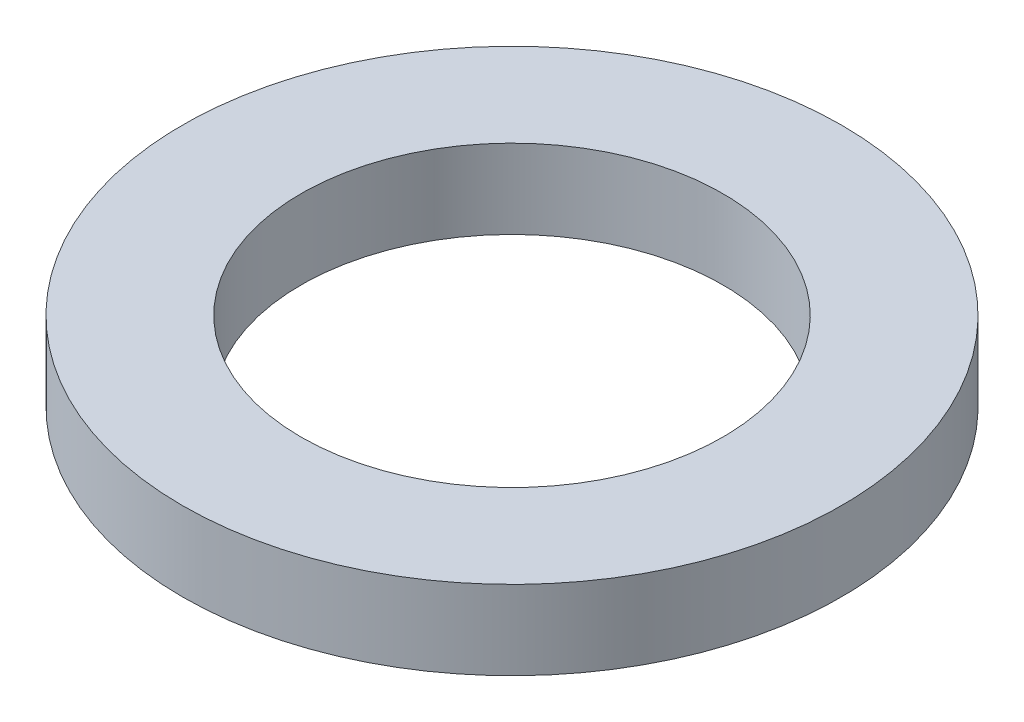
ISO-10303-21;
HEADER;
FILE_DESCRIPTION(('STEP AP214'),'2;1');
FILE_NAME('part.step','',(''),(''),'','','');
FILE_SCHEMA(('AUTOMOTIVE_DESIGN { 1 0 10303 214 1 1 1 1 }'));
ENDSEC;
DATA;
#1=APPLICATION_CONTEXT('core data for automotive mechanical design processes');
#2=APPLICATION_PROTOCOL_DEFINITION('international standard','automotive_design',2000,#1);
#3=PRODUCT_CONTEXT('',#1,'mechanical');
#4=PRODUCT('Part','Part','',(#3));
#5=PRODUCT_RELATED_PRODUCT_CATEGORY('part','',(#4));
#6=PRODUCT_DEFINITION_FORMATION('','',#4);
#7=PRODUCT_DEFINITION_CONTEXT('part definition',#1,'design');
#8=PRODUCT_DEFINITION('design','',#6,#7);
#9=PRODUCT_DEFINITION_SHAPE('','',#8);
#10=(LENGTH_UNIT() NAMED_UNIT(*) SI_UNIT(.MILLI.,.METRE.));
#11=(NAMED_UNIT(*) PLANE_ANGLE_UNIT() SI_UNIT($,.RADIAN.));
#12=(NAMED_UNIT(*) SI_UNIT($,.STERADIAN.) SOLID_ANGLE_UNIT());
#13=UNCERTAINTY_MEASURE_WITH_UNIT(LENGTH_MEASURE(1.E-05),#10,'distance_accuracy_value','');
#14=(GEOMETRIC_REPRESENTATION_CONTEXT(3) GLOBAL_UNCERTAINTY_ASSIGNED_CONTEXT((#13)) GLOBAL_UNIT_ASSIGNED_CONTEXT((#10,
#11,#12)) REPRESENTATION_CONTEXT('',''));
#15=CARTESIAN_POINT('',(0.,0.,0.));
#16=DIRECTION('',(0.,0.,1.));
#17=DIRECTION('',(1.,0.,0.));
#18=AXIS2_PLACEMENT_3D('',#15,#16,#17);
#19=CARTESIAN_POINT('',(0.,15.,0.));
#20=DIRECTION('',(0.,-1.,0.));
#21=DIRECTION('',(0.,0.,-1.));
#22=AXIS2_PLACEMENT_3D('',#19,#20,#21);
#23=CYLINDRICAL_SURFACE('',#22,62.5);
#24=CARTESIAN_POINT('',(0.,15.,0.));
#25=DIRECTION('',(0.,1.,0.));
#26=DIRECTION('',(0.,0.,1.));
#27=AXIS2_PLACEMENT_3D('',#24,#25,#26);
#28=CIRCLE('',#27,62.5);
#29=CARTESIAN_POINT('',(0.,15.,62.5));
#30=VERTEX_POINT('',#29);
#31=EDGE_CURVE('E10',#30,#30,#28,.T.);
#32=ORIENTED_EDGE('',*,*,#31,.F.);
#33=EDGE_LOOP('',(#32));
#34=FACE_BOUND('',#33,.T.);
#35=CARTESIAN_POINT('',(0.,0.,0.));
#36=DIRECTION('',(0.,1.,0.));
#37=DIRECTION('',(0.,0.,1.));
#38=AXIS2_PLACEMENT_3D('',#35,#36,#37);
#39=CIRCLE('',#38,62.5);
#40=CARTESIAN_POINT('',(0.,0.,62.5));
#41=VERTEX_POINT('',#40);
#42=EDGE_CURVE('E37',#41,#41,#39,.T.);
#43=ORIENTED_EDGE('',*,*,#42,.T.);
#44=EDGE_LOOP('',(#43));
#45=FACE_BOUND('',#44,.T.);
#46=ADVANCED_FACE('F40',(#34,#45),#23,.T.);
#47=CARTESIAN_POINT('',(0.,15.,0.));
#48=DIRECTION('',(0.,1.,0.));
#49=DIRECTION('',(0.,0.,1.));
#50=AXIS2_PLACEMENT_3D('',#47,#48,#49);
#51=PLANE('',#50);
#52=CARTESIAN_POINT('',(0.,15.,0.));
#53=DIRECTION('',(0.,1.,0.));
#54=DIRECTION('',(0.,0.,1.));
#55=AXIS2_PLACEMENT_3D('',#52,#53,#54);
#56=CIRCLE('',#55,40.);
#57=CARTESIAN_POINT('',(0.,15.,40.));
#58=VERTEX_POINT('',#57);
#59=EDGE_CURVE('E50',#58,#58,#56,.T.);
#60=ORIENTED_EDGE('',*,*,#59,.F.);
#61=EDGE_LOOP('',(#60));
#62=FACE_BOUND('',#61,.T.);
#63=ORIENTED_EDGE('',*,*,#31,.T.);
#64=EDGE_LOOP('',(#63));
#65=FACE_BOUND('',#64,.T.);
#66=ADVANCED_FACE('F59',(#62,#65),#51,.T.);
#67=CARTESIAN_POINT('',(0.,0.,0.));
#68=DIRECTION('',(0.,1.,0.));
#69=DIRECTION('',(0.,0.,1.));
#70=AXIS2_PLACEMENT_3D('',#67,#68,#69);
#71=PLANE('',#70);
#72=CARTESIAN_POINT('',(0.,0.,0.));
#73=DIRECTION('',(0.,1.,0.));
#74=DIRECTION('',(0.,0.,1.));
#75=AXIS2_PLACEMENT_3D('',#72,#73,#74);
#76=CIRCLE('',#75,40.);
#77=CARTESIAN_POINT('',(0.,0.,40.));
#78=VERTEX_POINT('',#77);
#79=EDGE_CURVE('E47',#78,#78,#76,.T.);
#80=ORIENTED_EDGE('',*,*,#79,.T.);
#81=EDGE_LOOP('',(#80));
#82=FACE_BOUND('',#81,.T.);
#83=ORIENTED_EDGE('',*,*,#42,.F.);
#84=EDGE_LOOP('',(#83));
#85=FACE_BOUND('',#84,.T.);
#86=ADVANCED_FACE('F58',(#82,#85),#71,.F.);
#87=CARTESIAN_POINT('',(0.,15.,0.));
#88=DIRECTION('',(0.,-1.,0.));
#89=DIRECTION('',(0.,0.,-1.));
#90=AXIS2_PLACEMENT_3D('',#87,#88,#89);
#91=CYLINDRICAL_SURFACE('',#90,40.);
#92=ORIENTED_EDGE('',*,*,#59,.T.);
#93=EDGE_LOOP('',(#92));
#94=FACE_BOUND('',#93,.T.);
#95=ORIENTED_EDGE('',*,*,#79,.F.);
#96=EDGE_LOOP('',(#95));
#97=FACE_BOUND('',#96,.T.);
#98=ADVANCED_FACE('F54',(#94,#97),#91,.F.);
#99=CLOSED_SHELL('',(#46,#66,#86,#98));
#100=MANIFOLD_SOLID_BREP('B2',#99);
#101=ADVANCED_BREP_SHAPE_REPRESENTATION('',(#18,#100),#14);
#102=SHAPE_DEFINITION_REPRESENTATION(#9,#101);
ENDSEC;
END-ISO-10303-21;
